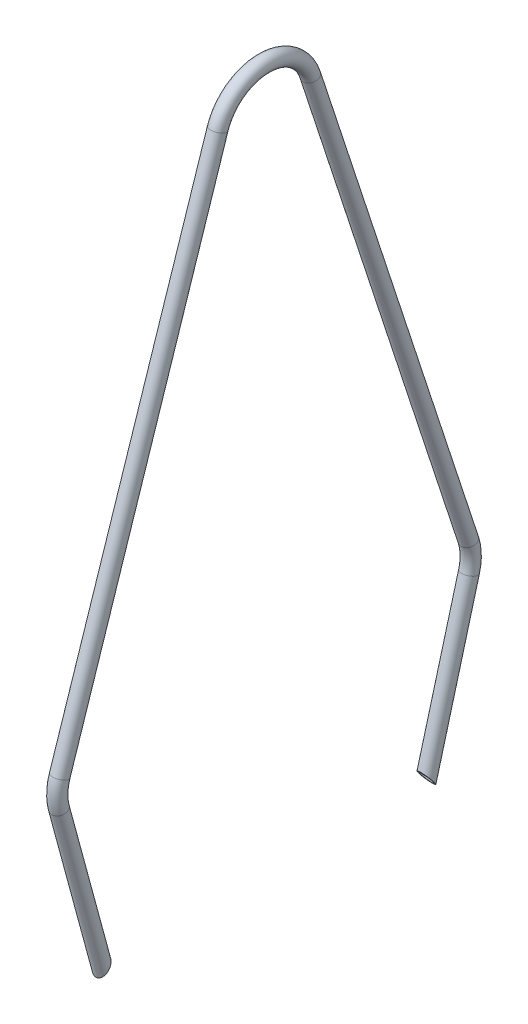
ISO-10303-21;
HEADER;
FILE_DESCRIPTION(('STEP AP214'),'2;1');
FILE_NAME('part.step','',(''),(''),'','','');
FILE_SCHEMA(('AUTOMOTIVE_DESIGN { 1 0 10303 214 1 1 1 1 }'));
ENDSEC;
DATA;
#1=APPLICATION_CONTEXT('core data for automotive mechanical design processes');
#2=APPLICATION_PROTOCOL_DEFINITION('international standard','automotive_design',2000,#1);
#3=PRODUCT_CONTEXT('',#1,'mechanical');
#4=PRODUCT('Part','Part','',(#3));
#5=PRODUCT_RELATED_PRODUCT_CATEGORY('part','',(#4));
#6=PRODUCT_DEFINITION_FORMATION('','',#4);
#7=PRODUCT_DEFINITION_CONTEXT('part definition',#1,'design');
#8=PRODUCT_DEFINITION('design','',#6,#7);
#9=PRODUCT_DEFINITION_SHAPE('','',#8);
#10=(LENGTH_UNIT() NAMED_UNIT(*) SI_UNIT(.MILLI.,.METRE.));
#11=(NAMED_UNIT(*) PLANE_ANGLE_UNIT() SI_UNIT($,.RADIAN.));
#12=(NAMED_UNIT(*) SI_UNIT($,.STERADIAN.) SOLID_ANGLE_UNIT());
#13=UNCERTAINTY_MEASURE_WITH_UNIT(LENGTH_MEASURE(1.E-05),#10,'distance_accuracy_value','');
#14=(GEOMETRIC_REPRESENTATION_CONTEXT(3) GLOBAL_UNCERTAINTY_ASSIGNED_CONTEXT((#13)) GLOBAL_UNIT_ASSIGNED_CONTEXT((#10,
#11,#12)) REPRESENTATION_CONTEXT('',''));
#15=CARTESIAN_POINT('',(0.,0.,0.));
#16=DIRECTION('',(0.,0.,1.));
#17=DIRECTION('',(1.,0.,0.));
#18=AXIS2_PLACEMENT_3D('',#15,#16,#17);
#19=CARTESIAN_POINT('',(1799.99999999996,1102.7,0.));
#20=DIRECTION('',(1.,0.,0.));
#21=DIRECTION('',(0.,0.,-1.));
#22=AXIS2_PLACEMENT_3D('',#19,#20,#21);
#23=TOROIDAL_SURFACE('',#22,82.5499999999893,9.65000000000003);
#24=CARTESIAN_POINT('',(1799.99999999996,1128.44535180018,-78.4326421885894));
#25=DIRECTION('',(0.,-0.950122861158082,-0.311875854635752));
#26=DIRECTION('',(0.,0.311875854635752,-0.950122861158082));
#27=AXIS2_PLACEMENT_3D('',#24,#25,#26);
#28=CIRCLE('',#27,9.65000000000003);
#29=CARTESIAN_POINT('',(1799.99999999996,1131.45495379741,-87.6013277987649));
#30=VERTEX_POINT('',#29);
#31=EDGE_CURVE('E51',#30,#30,#28,.T.);
#32=CARTESIAN_POINT('',(1799.99999999996,1128.44535180018,78.4326421885895));
#33=DIRECTION('',(0.,-0.950122861158082,0.31187585463575));
#34=DIRECTION('',(0.,-0.31187585463575,-0.950122861158082));
#35=AXIS2_PLACEMENT_3D('',#32,#33,#34);
#36=CIRCLE('',#35,9.65000000000003);
#37=CARTESIAN_POINT('',(1799.99999999996,1131.45495379741,87.601327798765));
#38=VERTEX_POINT('',#37);
#39=EDGE_CURVE('E10',#38,#38,#36,.T.);
#40=CARTESIAN_POINT('',(1799.99999999996,1102.7,0.));
#41=DIRECTION('',(1.,0.,0.));
#42=DIRECTION('',(0.,0.,-1.));
#43=AXIS2_PLACEMENT_3D('',#40,#41,#42);
#44=CIRCLE('',#43,92.1999999999893);
#45=EDGE_CURVE('',#30,#38,#44,.T.);
#46=ORIENTED_EDGE('',*,*,#31,.T.);
#47=ORIENTED_EDGE('',*,*,#39,.T.);
#48=ORIENTED_EDGE('',*,*,#45,.T.);
#49=ORIENTED_EDGE('',*,*,#45,.F.);
#50=EDGE_LOOP('',(#46,#48,#47,#49));
#51=FACE_BOUND('',#50,.T.);
#52=ADVANCED_FACE('F38',(#51),#23,.F.);
#53=CARTESIAN_POINT('',(1799.99999999996,1102.7,0.));
#54=DIRECTION('',(1.,0.,0.));
#55=DIRECTION('',(0.,0.,-1.));
#56=AXIS2_PLACEMENT_3D('',#53,#54,#55);
#57=TOROIDAL_SURFACE('',#56,82.5499999999893,12.7000000000001);
#58=CARTESIAN_POINT('',(1799.99999999996,1128.44535180018,-78.4326421885894));
#59=DIRECTION('',(0.,-0.950122861158082,-0.311875854635752));
#60=DIRECTION('',(0.,0.311875854635752,-0.950122861158082));
#61=AXIS2_PLACEMENT_3D('',#58,#59,#60);
#62=CIRCLE('',#61,12.7000000000001);
#63=CARTESIAN_POINT('',(1799.99999999996,1132.40617515405,-90.4992025252971));
#64=VERTEX_POINT('',#63);
#65=EDGE_CURVE('E57',#64,#64,#62,.F.);
#66=CARTESIAN_POINT('',(1799.99999999996,1128.44535180018,78.4326421885895));
#67=DIRECTION('',(0.,-0.950122861158082,0.31187585463575));
#68=DIRECTION('',(0.,-0.31187585463575,-0.950122861158082));
#69=AXIS2_PLACEMENT_3D('',#66,#67,#68);
#70=CIRCLE('',#69,12.7000000000001);
#71=CARTESIAN_POINT('',(1799.99999999996,1132.40617515405,90.4992025252972));
#72=VERTEX_POINT('',#71);
#73=EDGE_CURVE('E45',#72,#72,#70,.F.);
#74=CARTESIAN_POINT('',(1799.99999999996,1102.7,0.));
#75=DIRECTION('',(1.,0.,0.));
#76=DIRECTION('',(0.,0.,-1.));
#77=AXIS2_PLACEMENT_3D('',#74,#75,#76);
#78=CIRCLE('',#77,95.2499999999894);
#79=EDGE_CURVE('',#64,#72,#78,.T.);
#80=ORIENTED_EDGE('',*,*,#65,.T.);
#81=ORIENTED_EDGE('',*,*,#73,.T.);
#82=ORIENTED_EDGE('',*,*,#79,.T.);
#83=ORIENTED_EDGE('',*,*,#79,.F.);
#84=EDGE_LOOP('',(#80,#82,#81,#83));
#85=FACE_BOUND('',#84,.T.);
#86=ADVANCED_FACE('F140',(#85),#57,.T.);
#87=CARTESIAN_POINT('',(1799.99999999996,1128.44535180018,-78.4326421885894));
#88=DIRECTION('',(0.,-0.950122861158083,-0.311875854635749));
#89=DIRECTION('',(0.,0.311875854635749,-0.950122861158082));
#90=AXIS2_PLACEMENT_3D('',#87,#88,#89);
#91=CYLINDRICAL_SURFACE('',#90,9.65000000000003);
#92=ORIENTED_EDGE('',*,*,#31,.F.);
#93=EDGE_LOOP('',(#92));
#94=FACE_BOUND('',#93,.T.);
#95=CARTESIAN_POINT('',(1799.99999999996,313.578191864488,-345.911093985641));
#96=DIRECTION('',(0.,0.950122861158082,0.311875854635752));
#97=DIRECTION('',(0.,-0.311875854635752,0.950122861158082));
#98=AXIS2_PLACEMENT_3D('',#95,#96,#97);
#99=CIRCLE('',#98,9.65000000000003);
#100=CARTESIAN_POINT('',(1799.99999999996,316.587793861723,-355.079779595817));
#101=VERTEX_POINT('',#100);
#102=EDGE_CURVE('E72',#101,#101,#99,.F.);
#103=ORIENTED_EDGE('',*,*,#102,.T.);
#104=EDGE_LOOP('',(#103));
#105=FACE_BOUND('',#104,.T.);
#106=ADVANCED_FACE('F145',(#94,#105),#91,.F.);
#107=CARTESIAN_POINT('',(1799.99999999996,1128.44535180018,-78.4326421885894));
#108=DIRECTION('',(0.,-0.950122861158083,-0.311875854635749));
#109=DIRECTION('',(0.,0.311875854635749,-0.950122861158082));
#110=AXIS2_PLACEMENT_3D('',#107,#108,#109);
#111=CYLINDRICAL_SURFACE('',#110,12.7000000000001);
#112=ORIENTED_EDGE('',*,*,#65,.F.);
#113=EDGE_LOOP('',(#112));
#114=FACE_BOUND('',#113,.T.);
#115=CARTESIAN_POINT('',(1799.99999999996,313.578191864488,-345.911093985641));
#116=DIRECTION('',(0.,-0.950122861158082,-0.311875854635752));
#117=DIRECTION('',(0.,0.311875854635752,-0.950122861158082));
#118=AXIS2_PLACEMENT_3D('',#115,#116,#117);
#119=CIRCLE('',#118,12.7000000000001);
#120=CARTESIAN_POINT('',(1799.99999999996,317.539015218362,-357.977654322349));
#121=VERTEX_POINT('',#120);
#122=EDGE_CURVE('E63',#121,#121,#119,.T.);
#123=ORIENTED_EDGE('',*,*,#122,.F.);
#124=EDGE_LOOP('',(#123));
#125=FACE_BOUND('',#124,.T.);
#126=ADVANCED_FACE('F151',(#114,#125),#111,.T.);
#127=CARTESIAN_POINT('',(1799.99999999996,287.832840064307,-267.478451797042));
#128=DIRECTION('',(-1.,0.,0.));
#129=DIRECTION('',(0.,0.,1.));
#130=AXIS2_PLACEMENT_3D('',#127,#128,#129);
#131=TOROIDAL_SURFACE('',#130,82.55,9.65000000000003);
#132=CARTESIAN_POINT('',(1799.99999999996,266.239692896315,-347.154285619986));
#133=DIRECTION('',(0.,-0.965182723476006,0.261576585923587));
#134=DIRECTION('',(0.,-0.261576585923587,-0.965182723476006));
#135=AXIS2_PLACEMENT_3D('',#132,#133,#134);
#136=CIRCLE('',#135,9.65000000000003);
#137=CARTESIAN_POINT('',(1799.99999999996,263.715478842152,-356.468298901529));
#138=VERTEX_POINT('',#137);
#139=EDGE_CURVE('E67',#138,#138,#136,.F.);
#140=CARTESIAN_POINT('',(1799.99999999996,287.832840064307,-267.478451797042));
#141=DIRECTION('',(-1.,0.,0.));
#142=DIRECTION('',(0.,0.,1.));
#143=AXIS2_PLACEMENT_3D('',#140,#141,#142);
#144=CIRCLE('',#143,92.2);
#145=EDGE_CURVE('',#101,#138,#144,.T.);
#146=ORIENTED_EDGE('',*,*,#102,.F.);
#147=ORIENTED_EDGE('',*,*,#139,.F.);
#148=ORIENTED_EDGE('',*,*,#145,.T.);
#149=ORIENTED_EDGE('',*,*,#145,.F.);
#150=EDGE_LOOP('',(#146,#148,#147,#149));
#151=FACE_BOUND('',#150,.T.);
#152=ADVANCED_FACE('F155',(#151),#131,.F.);
#153=CARTESIAN_POINT('',(1799.99999999996,287.832840064307,-267.478451797042));
#154=DIRECTION('',(-1.,0.,0.));
#155=DIRECTION('',(0.,0.,1.));
#156=AXIS2_PLACEMENT_3D('',#153,#154,#155);
#157=TOROIDAL_SURFACE('',#156,82.55,12.7000000000001);
#158=CARTESIAN_POINT('',(1799.99999999996,266.239692896315,-347.154285619986));
#159=DIRECTION('',(0.,-0.965182723476006,0.261576585923587));
#160=DIRECTION('',(0.,-0.261576585923587,-0.965182723476006));
#161=AXIS2_PLACEMENT_3D('',#158,#159,#160);
#162=CIRCLE('',#161,12.7000000000001);
#163=CARTESIAN_POINT('',(1799.99999999996,262.917670255085,-359.412106208131));
#164=VERTEX_POINT('',#163);
#165=EDGE_CURVE('E71',#164,#164,#162,.T.);
#166=CARTESIAN_POINT('',(1799.99999999996,287.832840064307,-267.478451797042));
#167=DIRECTION('',(-1.,0.,0.));
#168=DIRECTION('',(0.,0.,1.));
#169=AXIS2_PLACEMENT_3D('',#166,#167,#168);
#170=CIRCLE('',#169,95.2500000000001);
#171=EDGE_CURVE('',#121,#164,#170,.T.);
#172=ORIENTED_EDGE('',*,*,#122,.T.);
#173=ORIENTED_EDGE('',*,*,#165,.F.);
#174=ORIENTED_EDGE('',*,*,#171,.T.);
#175=ORIENTED_EDGE('',*,*,#171,.F.);
#176=EDGE_LOOP('',(#172,#174,#173,#175));
#177=FACE_BOUND('',#176,.T.);
#178=ADVANCED_FACE('F158',(#177),#157,.T.);
#179=CARTESIAN_POINT('',(1799.99999999996,266.239692896315,-347.154285619986));
#180=DIRECTION('',(0.,-0.965182723476007,0.261576585923584));
#181=DIRECTION('',(0.,-0.261576585923584,-0.965182723476007));
#182=AXIS2_PLACEMENT_3D('',#179,#180,#181);
#183=CYLINDRICAL_SURFACE('',#182,9.65000000000003);
#184=ORIENTED_EDGE('',*,*,#139,.T.);
#185=EDGE_LOOP('',(#184));
#186=FACE_BOUND('',#185,.T.);
#187=CARTESIAN_POINT('',(1799.99999999996,-3.99680288865056E-12,-275.000000000001));
#188=DIRECTION('',(0.,-0.607627934708573,0.794221815969439));
#189=DIRECTION('',(0.,-0.794221815969439,-0.607627934708573));
#190=AXIS2_PLACEMENT_3D('',#187,#188,#189);
#191=ELLIPSE('',#190,12.1502580336718,9.65000000000003);
#192=CARTESIAN_POINT('',(1799.99999999996,-9.65000000000405,-282.382836195177));
#193=VERTEX_POINT('',#192);
#194=EDGE_CURVE('E80',#193,#193,#191,.T.);
#195=ORIENTED_EDGE('',*,*,#194,.T.);
#196=EDGE_LOOP('',(#195));
#197=FACE_BOUND('',#196,.T.);
#198=ADVANCED_FACE('F162',(#186,#197),#183,.F.);
#199=CARTESIAN_POINT('',(1799.99999999996,266.239692896315,-347.154285619986));
#200=DIRECTION('',(0.,-0.965182723476007,0.261576585923584));
#201=DIRECTION('',(0.,-0.261576585923584,-0.965182723476007));
#202=AXIS2_PLACEMENT_3D('',#199,#200,#201);
#203=CYLINDRICAL_SURFACE('',#202,12.7000000000001);
#204=ORIENTED_EDGE('',*,*,#165,.T.);
#205=EDGE_LOOP('',(#204));
#206=FACE_BOUND('',#205,.T.);
#207=CARTESIAN_POINT('',(1799.99999999996,-3.99680288865056E-12,-275.000000000001));
#208=DIRECTION('',(0.,-0.607627934708573,0.794221815969439));
#209=DIRECTION('',(0.,-0.794221815969439,-0.607627934708573));
#210=AXIS2_PLACEMENT_3D('',#207,#208,#209);
#211=ELLIPSE('',#210,15.9904950287702,12.7000000000001);
#212=CARTESIAN_POINT('',(1799.99999999996,-12.7000000000041,-284.7162714693));
#213=VERTEX_POINT('',#212);
#214=EDGE_CURVE('E76',#213,#213,#211,.T.);
#215=ORIENTED_EDGE('',*,*,#214,.F.);
#216=EDGE_LOOP('',(#215));
#217=FACE_BOUND('',#216,.T.);
#218=ADVANCED_FACE('F136',(#206,#217),#203,.T.);
#219=CARTESIAN_POINT('',(1799.99999999996,-3.99680288865056E-12,-275.000000000001));
#220=DIRECTION('',(0.,-0.607627934708573,0.794221815969439));
#221=DIRECTION('',(0.,-0.794221815969439,-0.607627934708573));
#222=AXIS2_PLACEMENT_3D('',#219,#220,#221);
#223=PLANE('',#222);
#224=ORIENTED_EDGE('',*,*,#194,.F.);
#225=EDGE_LOOP('',(#224));
#226=FACE_BOUND('',#225,.T.);
#227=ORIENTED_EDGE('',*,*,#214,.T.);
#228=EDGE_LOOP('',(#227));
#229=FACE_BOUND('',#228,.T.);
#230=ADVANCED_FACE('F127',(#226,#229),#223,.T.);
#231=CARTESIAN_POINT('',(1799.99999999996,313.578191864488,345.911093985641));
#232=DIRECTION('',(0.,0.950122861158082,-0.31187585463575));
#233=DIRECTION('',(0.,0.31187585463575,0.950122861158083));
#234=AXIS2_PLACEMENT_3D('',#231,#232,#233);
#235=CYLINDRICAL_SURFACE('',#234,9.65000000000003);
#236=CARTESIAN_POINT('',(1799.99999999996,313.578191864488,345.911093985641));
#237=DIRECTION('',(0.,0.950122861158083,-0.31187585463575));
#238=DIRECTION('',(0.,0.31187585463575,0.950122861158082));
#239=AXIS2_PLACEMENT_3D('',#236,#237,#238);
#240=CIRCLE('',#239,9.65000000000003);
#241=CARTESIAN_POINT('',(1799.99999999996,316.587793861723,355.079779595817));
#242=VERTEX_POINT('',#241);
#243=EDGE_CURVE('E91',#242,#242,#240,.T.);
#244=ORIENTED_EDGE('',*,*,#243,.F.);
#245=EDGE_LOOP('',(#244));
#246=FACE_BOUND('',#245,.T.);
#247=ORIENTED_EDGE('',*,*,#39,.F.);
#248=EDGE_LOOP('',(#247));
#249=FACE_BOUND('',#248,.T.);
#250=ADVANCED_FACE('F124',(#246,#249),#235,.F.);
#251=CARTESIAN_POINT('',(1799.99999999996,313.578191864488,345.911093985641));
#252=DIRECTION('',(0.,0.950122861158082,-0.31187585463575));
#253=DIRECTION('',(0.,0.31187585463575,0.950122861158083));
#254=AXIS2_PLACEMENT_3D('',#251,#252,#253);
#255=CYLINDRICAL_SURFACE('',#254,12.7000000000001);
#256=CARTESIAN_POINT('',(1799.99999999996,313.578191864488,345.911093985641));
#257=DIRECTION('',(0.,-0.950122861158083,0.31187585463575));
#258=DIRECTION('',(0.,-0.31187585463575,-0.950122861158082));
#259=AXIS2_PLACEMENT_3D('',#256,#257,#258);
#260=CIRCLE('',#259,12.7000000000001);
#261=CARTESIAN_POINT('',(1799.99999999996,317.539015218362,357.977654322349));
#262=VERTEX_POINT('',#261);
#263=EDGE_CURVE('E84',#262,#262,#260,.T.);
#264=ORIENTED_EDGE('',*,*,#263,.F.);
#265=EDGE_LOOP('',(#264));
#266=FACE_BOUND('',#265,.T.);
#267=ORIENTED_EDGE('',*,*,#73,.F.);
#268=EDGE_LOOP('',(#267));
#269=FACE_BOUND('',#268,.T.);
#270=ADVANCED_FACE('F120',(#266,#269),#255,.T.);
#271=CARTESIAN_POINT('',(1799.99999999996,287.832840064307,267.478451797042));
#272=DIRECTION('',(1.,0.,0.));
#273=DIRECTION('',(0.,0.,-1.));
#274=AXIS2_PLACEMENT_3D('',#271,#272,#273);
#275=TOROIDAL_SURFACE('',#274,82.5499999999994,9.65000000000003);
#276=CARTESIAN_POINT('',(1799.99999999996,266.239692896315,347.154285619986));
#277=DIRECTION('',(0.,0.965182723476006,0.261576585923589));
#278=DIRECTION('',(0.,-0.261576585923589,0.965182723476005));
#279=AXIS2_PLACEMENT_3D('',#276,#277,#278);
#280=CIRCLE('',#279,9.65000000000003);
#281=CARTESIAN_POINT('',(1799.99999999996,263.715478842152,356.468298901529));
#282=VERTEX_POINT('',#281);
#283=EDGE_CURVE('E101',#282,#282,#280,.T.);
#284=CARTESIAN_POINT('',(1799.99999999996,287.832840064307,267.478451797042));
#285=DIRECTION('',(1.,0.,0.));
#286=DIRECTION('',(0.,0.,-1.));
#287=AXIS2_PLACEMENT_3D('',#284,#285,#286);
#288=CIRCLE('',#287,92.1999999999995);
#289=EDGE_CURVE('',#242,#282,#288,.T.);
#290=ORIENTED_EDGE('',*,*,#243,.T.);
#291=ORIENTED_EDGE('',*,*,#283,.F.);
#292=ORIENTED_EDGE('',*,*,#289,.T.);
#293=ORIENTED_EDGE('',*,*,#289,.F.);
#294=EDGE_LOOP('',(#290,#292,#291,#293));
#295=FACE_BOUND('',#294,.T.);
#296=ADVANCED_FACE('F116',(#295),#275,.F.);
#297=CARTESIAN_POINT('',(1799.99999999996,287.832840064307,267.478451797042));
#298=DIRECTION('',(1.,0.,0.));
#299=DIRECTION('',(0.,0.,-1.));
#300=AXIS2_PLACEMENT_3D('',#297,#298,#299);
#301=TOROIDAL_SURFACE('',#300,82.5499999999994,12.7000000000001);
#302=CARTESIAN_POINT('',(1799.99999999996,266.239692896315,347.154285619986));
#303=DIRECTION('',(0.,0.965182723476006,0.261576585923589));
#304=DIRECTION('',(0.,-0.261576585923589,0.965182723476005));
#305=AXIS2_PLACEMENT_3D('',#302,#303,#304);
#306=CIRCLE('',#305,12.7000000000001);
#307=CARTESIAN_POINT('',(1799.99999999996,262.917670255085,359.412106208131));
#308=VERTEX_POINT('',#307);
#309=EDGE_CURVE('E100',#308,#308,#306,.T.);
#310=CARTESIAN_POINT('',(1799.99999999996,287.832840064307,267.478451797042));
#311=DIRECTION('',(1.,0.,0.));
#312=DIRECTION('',(0.,0.,-1.));
#313=AXIS2_PLACEMENT_3D('',#310,#311,#312);
#314=CIRCLE('',#313,95.2499999999995);
#315=EDGE_CURVE('',#262,#308,#314,.T.);
#316=ORIENTED_EDGE('',*,*,#263,.T.);
#317=ORIENTED_EDGE('',*,*,#309,.T.);
#318=ORIENTED_EDGE('',*,*,#315,.T.);
#319=ORIENTED_EDGE('',*,*,#315,.F.);
#320=EDGE_LOOP('',(#316,#318,#317,#319));
#321=FACE_BOUND('',#320,.T.);
#322=ADVANCED_FACE('F119',(#321),#301,.T.);
#323=CARTESIAN_POINT('',(1799.99999999996,-4.21884749357559E-12,275.));
#324=DIRECTION('',(0.,0.965182723476006,0.261576585923588));
#325=DIRECTION('',(0.,-0.261576585923588,0.965182723476006));
#326=AXIS2_PLACEMENT_3D('',#323,#324,#325);
#327=CYLINDRICAL_SURFACE('',#326,9.65000000000003);
#328=ORIENTED_EDGE('',*,*,#283,.T.);
#329=EDGE_LOOP('',(#328));
#330=FACE_BOUND('',#329,.T.);
#331=CARTESIAN_POINT('',(1799.99999999996,-4.10782519111308E-12,275.));
#332=DIRECTION('',(0.,-0.607627934708573,-0.79422181596944));
#333=DIRECTION('',(0.,0.79422181596944,-0.607627934708573));
#334=AXIS2_PLACEMENT_3D('',#331,#332,#333);
#335=ELLIPSE('',#334,12.1502580336717,9.65000000000003);
#336=CARTESIAN_POINT('',(1799.99999999996,9.64999999999594,267.617163804824));
#337=VERTEX_POINT('',#336);
#338=EDGE_CURVE('E96',#337,#337,#335,.T.);
#339=ORIENTED_EDGE('',*,*,#338,.T.);
#340=EDGE_LOOP('',(#339));
#341=FACE_BOUND('',#340,.T.);
#342=ADVANCED_FACE('F113',(#330,#341),#327,.F.);
#343=CARTESIAN_POINT('',(1799.99999999996,-4.21884749357559E-12,275.));
#344=DIRECTION('',(0.,0.965182723476006,0.261576585923588));
#345=DIRECTION('',(0.,-0.261576585923588,0.965182723476006));
#346=AXIS2_PLACEMENT_3D('',#343,#344,#345);
#347=CYLINDRICAL_SURFACE('',#346,12.7000000000001);
#348=ORIENTED_EDGE('',*,*,#309,.F.);
#349=EDGE_LOOP('',(#348));
#350=FACE_BOUND('',#349,.T.);
#351=CARTESIAN_POINT('',(1799.99999999996,-4.10782519111308E-12,275.));
#352=DIRECTION('',(0.,-0.607627934708573,-0.79422181596944));
#353=DIRECTION('',(0.,0.79422181596944,-0.607627934708573));
#354=AXIS2_PLACEMENT_3D('',#351,#352,#353);
#355=ELLIPSE('',#354,15.9904950287701,12.7000000000001);
#356=CARTESIAN_POINT('',(1799.99999999996,12.699999999996,265.283728530701));
#357=VERTEX_POINT('',#356);
#358=EDGE_CURVE('E95',#357,#357,#355,.T.);
#359=ORIENTED_EDGE('',*,*,#358,.F.);
#360=EDGE_LOOP('',(#359));
#361=FACE_BOUND('',#360,.T.);
#362=ADVANCED_FACE('F243',(#350,#361),#347,.T.);
#363=CARTESIAN_POINT('',(1799.99999999996,-4.10782519111308E-12,275.));
#364=DIRECTION('',(0.,-0.607627934708573,-0.79422181596944));
#365=DIRECTION('',(0.,0.79422181596944,-0.607627934708573));
#366=AXIS2_PLACEMENT_3D('',#363,#364,#365);
#367=PLANE('',#366);
#368=ORIENTED_EDGE('',*,*,#338,.F.);
#369=EDGE_LOOP('',(#368));
#370=FACE_BOUND('',#369,.T.);
#371=ORIENTED_EDGE('',*,*,#358,.T.);
#372=EDGE_LOOP('',(#371));
#373=FACE_BOUND('',#372,.T.);
#374=ADVANCED_FACE('F252',(#370,#373),#367,.T.);
#375=CLOSED_SHELL('',(#52,#86,#106,#126,#152,#178,#198,#218,#230,#250,#270,#296,#322,#342,#362,#374));
#376=MANIFOLD_SOLID_BREP('B2',#375);
#377=ADVANCED_BREP_SHAPE_REPRESENTATION('',(#18,#376),#14);
#378=SHAPE_DEFINITION_REPRESENTATION(#9,#377);
ENDSEC;
END-ISO-10303-21;
